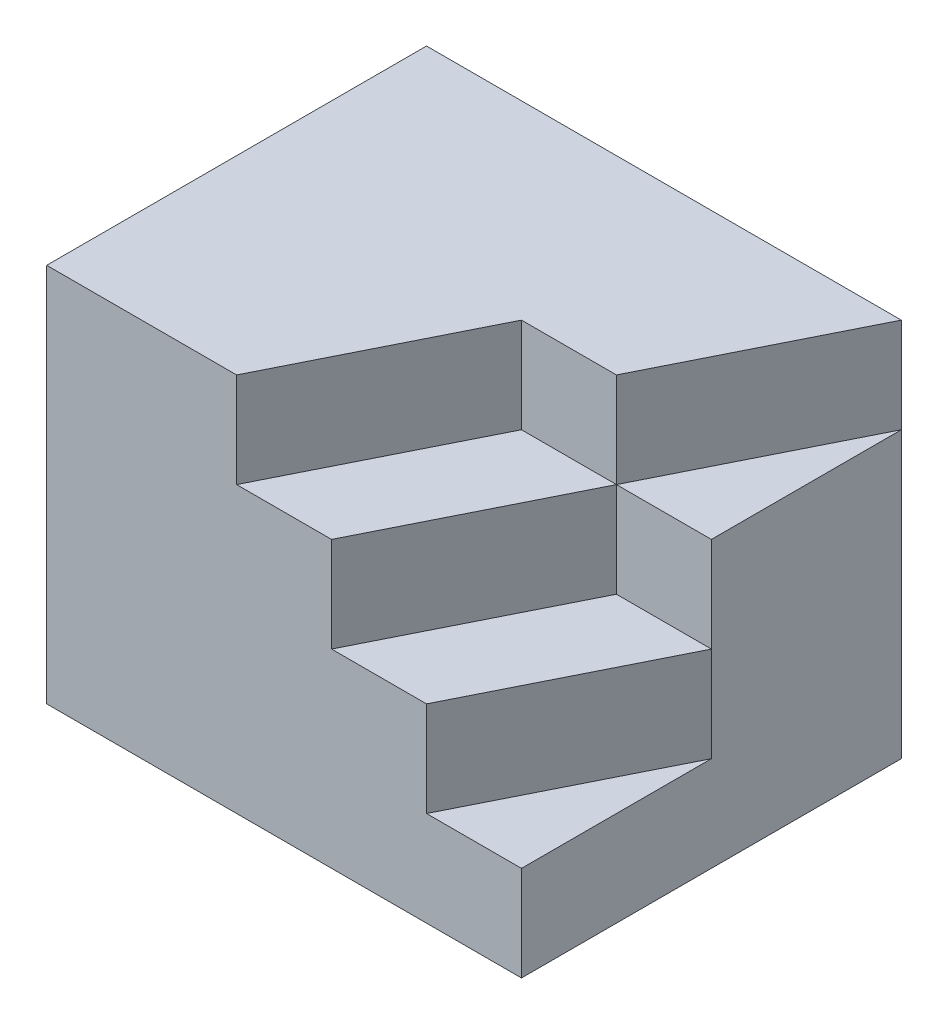
ISO-10303-21;
HEADER;
FILE_DESCRIPTION(('STEP AP214'),'2;1');
FILE_NAME('part.step','',(''),(''),'','','');
FILE_SCHEMA(('AUTOMOTIVE_DESIGN { 1 0 10303 214 1 1 1 1 }'));
ENDSEC;
DATA;
#1=APPLICATION_CONTEXT('core data for automotive mechanical design processes');
#2=APPLICATION_PROTOCOL_DEFINITION('international standard','automotive_design',2000,#1);
#3=PRODUCT_CONTEXT('',#1,'mechanical');
#4=PRODUCT('Part','Part','',(#3));
#5=PRODUCT_RELATED_PRODUCT_CATEGORY('part','',(#4));
#6=PRODUCT_DEFINITION_FORMATION('','',#4);
#7=PRODUCT_DEFINITION_CONTEXT('part definition',#1,'design');
#8=PRODUCT_DEFINITION('design','',#6,#7);
#9=PRODUCT_DEFINITION_SHAPE('','',#8);
#10=(LENGTH_UNIT() NAMED_UNIT(*) SI_UNIT(.MILLI.,.METRE.));
#11=(NAMED_UNIT(*) PLANE_ANGLE_UNIT() SI_UNIT($,.RADIAN.));
#12=(NAMED_UNIT(*) SI_UNIT($,.STERADIAN.) SOLID_ANGLE_UNIT());
#13=UNCERTAINTY_MEASURE_WITH_UNIT(LENGTH_MEASURE(1.E-05),#10,'distance_accuracy_value','');
#14=(GEOMETRIC_REPRESENTATION_CONTEXT(3) GLOBAL_UNCERTAINTY_ASSIGNED_CONTEXT((#13)) GLOBAL_UNIT_ASSIGNED_CONTEXT((#10,
#11,#12)) REPRESENTATION_CONTEXT('',''));
#15=CARTESIAN_POINT('',(0.,0.,0.));
#16=DIRECTION('',(0.,0.,1.));
#17=DIRECTION('',(1.,0.,0.));
#18=AXIS2_PLACEMENT_3D('',#15,#16,#17);
#19=CARTESIAN_POINT('',(-0.895238095238097,11.4285714285714,-0.533333333333332));
#20=DIRECTION('',(0.,0.,1.));
#21=DIRECTION('',(1.,0.,0.));
#22=AXIS2_PLACEMENT_3D('',#19,#20,#21);
#23=PLANE('',#22);
#24=DIRECTION('',(0.,-1.,0.));
#25=VECTOR('',#24,1.);
#26=CARTESIAN_POINT('',(0.604761904761902,10.4285714285714,-0.533333333333332));
#27=LINE('',#26,#25);
#28=CARTESIAN_POINT('',(0.604761904761902,10.4285714285714,-0.533333333333332));
#29=VERTEX_POINT('',#28);
#30=CARTESIAN_POINT('',(0.604761904761902,9.42857142857143,-0.533333333333332));
#31=VERTEX_POINT('',#30);
#32=EDGE_CURVE('E60',#29,#31,#27,.T.);
#33=ORIENTED_EDGE('',*,*,#32,.T.);
#34=DIRECTION('',(1.,0.,0.));
#35=VECTOR('',#34,1.);
#36=CARTESIAN_POINT('',(-0.895238095238097,9.42857142857143,-0.533333333333332));
#37=LINE('',#36,#35);
#38=CARTESIAN_POINT('',(1.6047619047619,9.42857142857143,-0.533333333333333));
#39=VERTEX_POINT('',#38);
#40=EDGE_CURVE('E11',#31,#39,#37,.T.);
#41=ORIENTED_EDGE('',*,*,#40,.T.);
#42=DIRECTION('',(0.,-1.,0.));
#43=VECTOR('',#42,1.);
#44=CARTESIAN_POINT('',(1.6047619047619,10.4285714285714,-0.533333333333333));
#45=LINE('',#44,#43);
#46=CARTESIAN_POINT('',(1.6047619047619,10.4285714285714,-0.533333333333333));
#47=VERTEX_POINT('',#46);
#48=EDGE_CURVE('E157',#47,#39,#45,.T.);
#49=ORIENTED_EDGE('',*,*,#48,.F.);
#50=DIRECTION('',(-1.,0.,0.));
#51=VECTOR('',#50,1.);
#52=CARTESIAN_POINT('',(-0.895238095238097,10.4285714285714,-0.533333333333332));
#53=LINE('',#52,#51);
#54=EDGE_CURVE('E152',#47,#29,#53,.T.);
#55=ORIENTED_EDGE('',*,*,#54,.T.);
#56=EDGE_LOOP('',(#33,#41,#49,#55));
#57=FACE_BOUND('',#56,.T.);
#58=ADVANCED_FACE('F38',(#57),#23,.T.);
#59=CARTESIAN_POINT('',(-0.895238095238097,9.42857142857143,-0.533333333333332));
#60=DIRECTION('',(0.,1.,0.));
#61=DIRECTION('',(0.,0.,1.));
#62=AXIS2_PLACEMENT_3D('',#59,#60,#61);
#63=PLANE('',#62);
#64=DIRECTION('',(0.447213595499958,0.,-0.894427190999916));
#65=VECTOR('',#64,1.);
#66=CARTESIAN_POINT('',(0.304761904761902,9.42857142857143,0.0666666666666672));
#67=LINE('',#66,#65);
#68=CARTESIAN_POINT('',(-0.395238095238098,9.42857142857143,1.46666666666667));
#69=VERTEX_POINT('',#68);
#70=EDGE_CURVE('E53',#69,#31,#67,.T.);
#71=ORIENTED_EDGE('',*,*,#70,.F.);
#72=DIRECTION('',(-1.,0.,0.));
#73=VECTOR('',#72,1.);
#74=CARTESIAN_POINT('',(-0.895238095238097,9.42857142857143,1.46666666666667));
#75=LINE('',#74,#73);
#76=CARTESIAN_POINT('',(0.604761904761903,9.42857142857143,1.46666666666667));
#77=VERTEX_POINT('',#76);
#78=EDGE_CURVE('E130',#77,#69,#75,.T.);
#79=ORIENTED_EDGE('',*,*,#78,.F.);
#80=DIRECTION('',(0.447213595499958,0.,-0.894427190999916));
#81=VECTOR('',#80,1.);
#82=CARTESIAN_POINT('',(1.1047619047619,9.42857142857143,0.466666666666667));
#83=LINE('',#82,#81);
#84=EDGE_CURVE('E189',#77,#39,#83,.T.);
#85=ORIENTED_EDGE('',*,*,#84,.T.);
#86=ORIENTED_EDGE('',*,*,#40,.F.);
#87=EDGE_LOOP('',(#71,#79,#85,#86));
#88=FACE_BOUND('',#87,.T.);
#89=ADVANCED_FACE('F254',(#88),#63,.T.);
#90=CARTESIAN_POINT('',(-0.895238095238097,8.42857142857143,-0.533333333333332));
#91=DIRECTION('',(0.,1.,0.));
#92=DIRECTION('',(0.,0.,1.));
#93=AXIS2_PLACEMENT_3D('',#90,#91,#92);
#94=PLANE('',#93);
#95=DIRECTION('',(0.,0.,1.));
#96=VECTOR('',#95,1.);
#97=CARTESIAN_POINT('',(1.6047619047619,8.42857142857143,-0.533333333333333));
#98=LINE('',#97,#96);
#99=CARTESIAN_POINT('',(1.6047619047619,8.42857142857143,-0.533333333333333));
#100=VERTEX_POINT('',#99);
#101=CARTESIAN_POINT('',(1.6047619047619,8.42857142857143,1.46666666666667));
#102=VERTEX_POINT('',#101);
#103=EDGE_CURVE('E201',#100,#102,#98,.T.);
#104=ORIENTED_EDGE('',*,*,#103,.F.);
#105=DIRECTION('',(-0.447213595499958,0.,0.894427190999916));
#106=VECTOR('',#105,1.);
#107=CARTESIAN_POINT('',(1.1047619047619,8.42857142857143,0.466666666666667));
#108=LINE('',#107,#106);
#109=CARTESIAN_POINT('',(0.604761904761903,8.42857142857143,1.46666666666667));
#110=VERTEX_POINT('',#109);
#111=EDGE_CURVE('E197',#100,#110,#108,.T.);
#112=ORIENTED_EDGE('',*,*,#111,.T.);
#113=DIRECTION('',(-1.,0.,0.));
#114=VECTOR('',#113,1.);
#115=CARTESIAN_POINT('',(-0.895238095238097,8.42857142857143,1.46666666666667));
#116=LINE('',#115,#114);
#117=EDGE_CURVE('E203',#102,#110,#116,.T.);
#118=ORIENTED_EDGE('',*,*,#117,.F.);
#119=EDGE_LOOP('',(#104,#112,#118));
#120=FACE_BOUND('',#119,.T.);
#121=ADVANCED_FACE('F258',(#120),#94,.T.);
#122=CARTESIAN_POINT('',(1.6047619047619,8.42857142857143,-0.533333333333333));
#123=DIRECTION('',(1.,0.,0.));
#124=DIRECTION('',(0.,0.,-1.));
#125=AXIS2_PLACEMENT_3D('',#122,#123,#124);
#126=PLANE('',#125);
#127=DIRECTION('',(0.,-1.,0.));
#128=VECTOR('',#127,1.);
#129=CARTESIAN_POINT('',(1.6047619047619,8.42857142857143,1.46666666666667));
#130=LINE('',#129,#128);
#131=CARTESIAN_POINT('',(1.6047619047619,7.42857142857143,1.46666666666667));
#132=VERTEX_POINT('',#131);
#133=EDGE_CURVE('E207',#102,#132,#130,.T.);
#134=ORIENTED_EDGE('',*,*,#133,.T.);
#135=DIRECTION('',(0.,0.,1.));
#136=VECTOR('',#135,1.);
#137=CARTESIAN_POINT('',(1.6047619047619,7.42857142857143,-0.533333333333333));
#138=LINE('',#137,#136);
#139=CARTESIAN_POINT('',(1.6047619047619,7.42857142857143,-2.53333333333333));
#140=VERTEX_POINT('',#139);
#141=EDGE_CURVE('E200',#140,#132,#138,.T.);
#142=ORIENTED_EDGE('',*,*,#141,.F.);
#143=DIRECTION('',(0.,-1.,0.));
#144=VECTOR('',#143,1.);
#145=CARTESIAN_POINT('',(1.6047619047619,8.42857142857143,-2.53333333333333));
#146=LINE('',#145,#144);
#147=CARTESIAN_POINT('',(1.6047619047619,10.4285714285714,-2.53333333333333));
#148=VERTEX_POINT('',#147);
#149=EDGE_CURVE('E46',#148,#140,#146,.T.);
#150=ORIENTED_EDGE('',*,*,#149,.F.);
#151=DIRECTION('',(0.,0.,1.));
#152=VECTOR('',#151,1.);
#153=CARTESIAN_POINT('',(1.6047619047619,10.4285714285714,-0.533333333333333));
#154=LINE('',#153,#152);
#155=EDGE_CURVE('E154',#148,#47,#154,.T.);
#156=ORIENTED_EDGE('',*,*,#155,.T.);
#157=ORIENTED_EDGE('',*,*,#48,.T.);
#158=DIRECTION('',(0.,-1.,0.));
#159=VECTOR('',#158,1.);
#160=CARTESIAN_POINT('',(1.6047619047619,9.42857142857143,-0.533333333333333));
#161=LINE('',#160,#159);
#162=EDGE_CURVE('E192',#39,#100,#161,.T.);
#163=ORIENTED_EDGE('',*,*,#162,.T.);
#164=ORIENTED_EDGE('',*,*,#103,.T.);
#165=EDGE_LOOP('',(#134,#142,#150,#156,#157,#163,#164));
#166=FACE_BOUND('',#165,.T.);
#167=ADVANCED_FACE('F40',(#166),#126,.T.);
#168=CARTESIAN_POINT('',(-0.895238095238098,8.42857142857143,-2.53333333333333));
#169=DIRECTION('',(0.,0.,1.));
#170=DIRECTION('',(1.,0.,0.));
#171=AXIS2_PLACEMENT_3D('',#168,#169,#170);
#172=PLANE('',#171);
#173=DIRECTION('',(-1.,0.,0.));
#174=VECTOR('',#173,1.);
#175=CARTESIAN_POINT('',(-0.895238095238098,7.42857142857143,-2.53333333333333));
#176=LINE('',#175,#174);
#177=CARTESIAN_POINT('',(-3.3952380952381,7.42857142857143,-2.53333333333333));
#178=VERTEX_POINT('',#177);
#179=EDGE_CURVE('E209',#140,#178,#176,.T.);
#180=ORIENTED_EDGE('',*,*,#179,.T.);
#181=DIRECTION('',(0.,-1.,0.));
#182=VECTOR('',#181,1.);
#183=CARTESIAN_POINT('',(-3.3952380952381,8.42857142857143,-2.53333333333333));
#184=LINE('',#183,#182);
#185=CARTESIAN_POINT('',(-3.3952380952381,11.4285714285714,-2.53333333333333));
#186=VERTEX_POINT('',#185);
#187=EDGE_CURVE('E220',#186,#178,#184,.T.);
#188=ORIENTED_EDGE('',*,*,#187,.F.);
#189=DIRECTION('',(-1.,0.,0.));
#190=VECTOR('',#189,1.);
#191=CARTESIAN_POINT('',(-0.895238095238098,11.4285714285714,-2.53333333333333));
#192=LINE('',#191,#190);
#193=CARTESIAN_POINT('',(1.6047619047619,11.4285714285714,-2.53333333333333));
#194=VERTEX_POINT('',#193);
#195=EDGE_CURVE('E165',#194,#186,#192,.T.);
#196=ORIENTED_EDGE('',*,*,#195,.F.);
#197=DIRECTION('',(0.,-1.,0.));
#198=VECTOR('',#197,1.);
#199=CARTESIAN_POINT('',(1.6047619047619,11.4285714285714,-2.53333333333333));
#200=LINE('',#199,#198);
#201=EDGE_CURVE('E182',#194,#148,#200,.T.);
#202=ORIENTED_EDGE('',*,*,#201,.T.);
#203=ORIENTED_EDGE('',*,*,#149,.T.);
#204=EDGE_LOOP('',(#180,#188,#196,#202,#203));
#205=FACE_BOUND('',#204,.T.);
#206=ADVANCED_FACE('F224',(#205),#172,.F.);
#207=CARTESIAN_POINT('',(-3.3952380952381,8.42857142857143,-0.533333333333332));
#208=DIRECTION('',(1.,0.,0.));
#209=DIRECTION('',(0.,0.,-1.));
#210=AXIS2_PLACEMENT_3D('',#207,#208,#209);
#211=PLANE('',#210);
#212=DIRECTION('',(0.,0.,1.));
#213=VECTOR('',#212,1.);
#214=CARTESIAN_POINT('',(-3.3952380952381,7.42857142857143,-0.533333333333332));
#215=LINE('',#214,#213);
#216=CARTESIAN_POINT('',(-3.3952380952381,7.42857142857143,1.46666666666667));
#217=VERTEX_POINT('',#216);
#218=EDGE_CURVE('E211',#178,#217,#215,.T.);
#219=ORIENTED_EDGE('',*,*,#218,.T.);
#220=DIRECTION('',(0.,-1.,0.));
#221=VECTOR('',#220,1.);
#222=CARTESIAN_POINT('',(-3.3952380952381,8.42857142857143,1.46666666666667));
#223=LINE('',#222,#221);
#224=CARTESIAN_POINT('',(-3.3952380952381,11.4285714285714,1.46666666666667));
#225=VERTEX_POINT('',#224);
#226=EDGE_CURVE('E217',#225,#217,#223,.T.);
#227=ORIENTED_EDGE('',*,*,#226,.F.);
#228=DIRECTION('',(0.,0.,1.));
#229=VECTOR('',#228,1.);
#230=CARTESIAN_POINT('',(-3.3952380952381,11.4285714285714,-0.533333333333332));
#231=LINE('',#230,#229);
#232=EDGE_CURVE('E168',#186,#225,#231,.T.);
#233=ORIENTED_EDGE('',*,*,#232,.F.);
#234=ORIENTED_EDGE('',*,*,#187,.T.);
#235=EDGE_LOOP('',(#219,#227,#233,#234));
#236=FACE_BOUND('',#235,.T.);
#237=ADVANCED_FACE('F240',(#236),#211,.F.);
#238=CARTESIAN_POINT('',(-0.895238095238097,8.42857142857143,1.46666666666667));
#239=DIRECTION('',(0.,0.,1.));
#240=DIRECTION('',(1.,0.,0.));
#241=AXIS2_PLACEMENT_3D('',#238,#239,#240);
#242=PLANE('',#241);
#243=ORIENTED_EDGE('',*,*,#78,.T.);
#244=DIRECTION('',(0.,-1.,0.));
#245=VECTOR('',#244,1.);
#246=CARTESIAN_POINT('',(-0.395238095238098,10.4285714285714,1.46666666666667));
#247=LINE('',#246,#245);
#248=CARTESIAN_POINT('',(-0.395238095238098,10.4285714285714,1.46666666666667));
#249=VERTEX_POINT('',#248);
#250=EDGE_CURVE('E125',#249,#69,#247,.T.);
#251=ORIENTED_EDGE('',*,*,#250,.F.);
#252=DIRECTION('',(-1.,0.,0.));
#253=VECTOR('',#252,1.);
#254=CARTESIAN_POINT('',(-0.895238095238097,10.4285714285714,1.46666666666667));
#255=LINE('',#254,#253);
#256=CARTESIAN_POINT('',(-1.3952380952381,10.4285714285714,1.46666666666667));
#257=VERTEX_POINT('',#256);
#258=EDGE_CURVE('E129',#249,#257,#255,.T.);
#259=ORIENTED_EDGE('',*,*,#258,.T.);
#260=DIRECTION('',(0.,-1.,0.));
#261=VECTOR('',#260,1.);
#262=CARTESIAN_POINT('',(-1.3952380952381,11.4285714285714,1.46666666666667));
#263=LINE('',#262,#261);
#264=CARTESIAN_POINT('',(-1.3952380952381,11.4285714285714,1.46666666666667));
#265=VERTEX_POINT('',#264);
#266=EDGE_CURVE('E180',#265,#257,#263,.T.);
#267=ORIENTED_EDGE('',*,*,#266,.F.);
#268=DIRECTION('',(-1.,0.,0.));
#269=VECTOR('',#268,1.);
#270=CARTESIAN_POINT('',(-0.895238095238097,11.4285714285714,1.46666666666667));
#271=LINE('',#270,#269);
#272=EDGE_CURVE('E171',#265,#225,#271,.T.);
#273=ORIENTED_EDGE('',*,*,#272,.T.);
#274=ORIENTED_EDGE('',*,*,#226,.T.);
#275=DIRECTION('',(-1.,0.,0.));
#276=VECTOR('',#275,1.);
#277=CARTESIAN_POINT('',(-0.895238095238097,7.42857142857143,1.46666666666667));
#278=LINE('',#277,#276);
#279=EDGE_CURVE('E204',#132,#217,#278,.T.);
#280=ORIENTED_EDGE('',*,*,#279,.F.);
#281=ORIENTED_EDGE('',*,*,#133,.F.);
#282=ORIENTED_EDGE('',*,*,#117,.T.);
#283=DIRECTION('',(0.,-1.,0.));
#284=VECTOR('',#283,1.);
#285=CARTESIAN_POINT('',(0.604761904761903,9.42857142857143,1.46666666666667));
#286=LINE('',#285,#284);
#287=EDGE_CURVE('E195',#77,#110,#286,.T.);
#288=ORIENTED_EDGE('',*,*,#287,.F.);
#289=EDGE_LOOP('',(#243,#251,#259,#267,#273,#274,#280,#281,#282,#288));
#290=FACE_BOUND('',#289,.T.);
#291=ADVANCED_FACE('F127',(#290),#242,.T.);
#292=CARTESIAN_POINT('',(-0.895238095238097,7.42857142857143,-0.533333333333332));
#293=DIRECTION('',(0.,1.,0.));
#294=DIRECTION('',(0.,0.,1.));
#295=AXIS2_PLACEMENT_3D('',#292,#293,#294);
#296=PLANE('',#295);
#297=ORIENTED_EDGE('',*,*,#279,.T.);
#298=ORIENTED_EDGE('',*,*,#218,.F.);
#299=ORIENTED_EDGE('',*,*,#179,.F.);
#300=ORIENTED_EDGE('',*,*,#141,.T.);
#301=EDGE_LOOP('',(#297,#298,#299,#300));
#302=FACE_BOUND('',#301,.T.);
#303=ADVANCED_FACE('F232',(#302),#296,.F.);
#304=CARTESIAN_POINT('',(1.1047619047619,9.42857142857143,0.466666666666667));
#305=DIRECTION('',(-0.894427190999916,0.,-0.447213595499958));
#306=DIRECTION('',(-0.447213595499958,0.,0.894427190999916));
#307=AXIS2_PLACEMENT_3D('',#304,#305,#306);
#308=PLANE('',#307);
#309=ORIENTED_EDGE('',*,*,#111,.F.);
#310=ORIENTED_EDGE('',*,*,#162,.F.);
#311=ORIENTED_EDGE('',*,*,#84,.F.);
#312=ORIENTED_EDGE('',*,*,#287,.T.);
#313=EDGE_LOOP('',(#309,#310,#311,#312));
#314=FACE_BOUND('',#313,.T.);
#315=ADVANCED_FACE('F256',(#314),#308,.F.);
#316=DIRECTION('',(-1.,0.,0.));
#317=VECTOR('',#316,1.);
#318=CARTESIAN_POINT('',(-0.895238095238097,10.4285714285714,-0.533333333333332));
#319=LINE('',#318,#317);
#320=CARTESIAN_POINT('',(-0.395238095238098,10.4285714285714,-0.533333333333332));
#321=VERTEX_POINT('',#320);
#322=EDGE_CURVE('E142',#29,#321,#319,.T.);
#323=ORIENTED_EDGE('',*,*,#322,.F.);
#324=DIRECTION('',(0.,-1.,0.));
#325=VECTOR('',#324,1.);
#326=CARTESIAN_POINT('',(0.604761904761902,11.4285714285714,-0.533333333333332));
#327=LINE('',#326,#325);
#328=CARTESIAN_POINT('',(0.604761904761902,11.4285714285714,-0.533333333333332));
#329=VERTEX_POINT('',#328);
#330=EDGE_CURVE('E185',#329,#29,#327,.T.);
#331=ORIENTED_EDGE('',*,*,#330,.F.);
#332=DIRECTION('',(-1.,0.,0.));
#333=VECTOR('',#332,1.);
#334=CARTESIAN_POINT('',(-0.895238095238097,11.4285714285714,-0.533333333333332));
#335=LINE('',#334,#333);
#336=CARTESIAN_POINT('',(-0.395238095238098,11.4285714285714,-0.533333333333332));
#337=VERTEX_POINT('',#336);
#338=EDGE_CURVE('E160',#329,#337,#335,.T.);
#339=ORIENTED_EDGE('',*,*,#338,.T.);
#340=DIRECTION('',(0.,-1.,0.));
#341=VECTOR('',#340,1.);
#342=CARTESIAN_POINT('',(-0.395238095238098,11.4285714285714,-0.533333333333332));
#343=LINE('',#342,#341);
#344=EDGE_CURVE('E177',#337,#321,#343,.T.);
#345=ORIENTED_EDGE('',*,*,#344,.T.);
#346=EDGE_LOOP('',(#323,#331,#339,#345));
#347=FACE_BOUND('',#346,.T.);
#348=ADVANCED_FACE('F270',(#347),#23,.T.);
#349=CARTESIAN_POINT('',(0.304761904761903,11.4285714285714,0.0666666666666673));
#350=DIRECTION('',(-0.894427190999916,0.,-0.447213595499958));
#351=DIRECTION('',(-0.447213595499958,0.,0.894427190999916));
#352=AXIS2_PLACEMENT_3D('',#349,#350,#351);
#353=PLANE('',#352);
#354=ORIENTED_EDGE('',*,*,#330,.T.);
#355=DIRECTION('',(0.447213595499958,0.,-0.894427190999916));
#356=VECTOR('',#355,1.);
#357=CARTESIAN_POINT('',(0.304761904761903,10.4285714285714,0.0666666666666673));
#358=LINE('',#357,#356);
#359=EDGE_CURVE('E149',#29,#148,#358,.T.);
#360=ORIENTED_EDGE('',*,*,#359,.T.);
#361=ORIENTED_EDGE('',*,*,#201,.F.);
#362=DIRECTION('',(0.447213595499958,0.,-0.894427190999916));
#363=VECTOR('',#362,1.);
#364=CARTESIAN_POINT('',(0.304761904761903,11.4285714285714,0.0666666666666673));
#365=LINE('',#364,#363);
#366=EDGE_CURVE('E163',#329,#194,#365,.T.);
#367=ORIENTED_EDGE('',*,*,#366,.F.);
#368=EDGE_LOOP('',(#354,#360,#361,#367));
#369=FACE_BOUND('',#368,.T.);
#370=ADVANCED_FACE('F247',(#369),#353,.F.);
#371=CARTESIAN_POINT('',(-0.495238095238098,11.4285714285714,-0.333333333333333));
#372=DIRECTION('',(0.894427190999916,0.,0.447213595499958));
#373=DIRECTION('',(0.447213595499958,0.,-0.894427190999916));
#374=AXIS2_PLACEMENT_3D('',#371,#372,#373);
#375=PLANE('',#374);
#376=DIRECTION('',(-0.447213595499958,0.,0.894427190999916));
#377=VECTOR('',#376,1.);
#378=CARTESIAN_POINT('',(-0.495238095238098,10.4285714285714,-0.333333333333333));
#379=LINE('',#378,#377);
#380=EDGE_CURVE('E141',#321,#257,#379,.T.);
#381=ORIENTED_EDGE('',*,*,#380,.F.);
#382=ORIENTED_EDGE('',*,*,#344,.F.);
#383=DIRECTION('',(-0.447213595499958,0.,0.894427190999916));
#384=VECTOR('',#383,1.);
#385=CARTESIAN_POINT('',(-0.495238095238098,11.4285714285714,-0.333333333333333));
#386=LINE('',#385,#384);
#387=EDGE_CURVE('E174',#337,#265,#386,.T.);
#388=ORIENTED_EDGE('',*,*,#387,.T.);
#389=ORIENTED_EDGE('',*,*,#266,.T.);
#390=EDGE_LOOP('',(#381,#382,#388,#389));
#391=FACE_BOUND('',#390,.T.);
#392=ADVANCED_FACE('F280',(#391),#375,.T.);
#393=CARTESIAN_POINT('',(-0.895238095238097,11.4285714285714,-0.533333333333332));
#394=DIRECTION('',(0.,1.,0.));
#395=DIRECTION('',(0.,0.,1.));
#396=AXIS2_PLACEMENT_3D('',#393,#394,#395);
#397=PLANE('',#396);
#398=ORIENTED_EDGE('',*,*,#338,.F.);
#399=ORIENTED_EDGE('',*,*,#366,.T.);
#400=ORIENTED_EDGE('',*,*,#195,.T.);
#401=ORIENTED_EDGE('',*,*,#232,.T.);
#402=ORIENTED_EDGE('',*,*,#272,.F.);
#403=ORIENTED_EDGE('',*,*,#387,.F.);
#404=EDGE_LOOP('',(#398,#399,#400,#401,#402,#403));
#405=FACE_BOUND('',#404,.T.);
#406=ADVANCED_FACE('F243',(#405),#397,.T.);
#407=CARTESIAN_POINT('',(-0.895238095238097,10.4285714285714,-0.533333333333332));
#408=DIRECTION('',(0.,1.,0.));
#409=DIRECTION('',(0.,0.,1.));
#410=AXIS2_PLACEMENT_3D('',#407,#408,#409);
#411=PLANE('',#410);
#412=ORIENTED_EDGE('',*,*,#359,.F.);
#413=ORIENTED_EDGE('',*,*,#54,.F.);
#414=ORIENTED_EDGE('',*,*,#155,.F.);
#415=EDGE_LOOP('',(#412,#413,#414));
#416=FACE_BOUND('',#415,.T.);
#417=ADVANCED_FACE('F251',(#416),#411,.T.);
#418=CARTESIAN_POINT('',(0.304761904761903,10.4285714285714,0.0666666666666673));
#419=DIRECTION('',(0.894427190999916,0.,0.447213595499958));
#420=DIRECTION('',(0.447213595499958,0.,-0.894427190999916));
#421=AXIS2_PLACEMENT_3D('',#418,#419,#420);
#422=PLANE('',#421);
#423=ORIENTED_EDGE('',*,*,#250,.T.);
#424=ORIENTED_EDGE('',*,*,#70,.T.);
#425=ORIENTED_EDGE('',*,*,#32,.F.);
#426=DIRECTION('',(-0.447213595499958,0.,0.894427190999916));
#427=VECTOR('',#426,1.);
#428=CARTESIAN_POINT('',(0.304761904761903,10.4285714285714,0.0666666666666673));
#429=LINE('',#428,#427);
#430=EDGE_CURVE('E132',#29,#249,#429,.T.);
#431=ORIENTED_EDGE('',*,*,#430,.T.);
#432=EDGE_LOOP('',(#423,#424,#425,#431));
#433=FACE_BOUND('',#432,.T.);
#434=ADVANCED_FACE('F135',(#433),#422,.T.);
#435=CARTESIAN_POINT('',(-0.895238095238097,10.4285714285714,-0.533333333333332));
#436=DIRECTION('',(0.,1.,0.));
#437=DIRECTION('',(0.,0.,1.));
#438=AXIS2_PLACEMENT_3D('',#435,#436,#437);
#439=PLANE('',#438);
#440=ORIENTED_EDGE('',*,*,#430,.F.);
#441=ORIENTED_EDGE('',*,*,#322,.T.);
#442=ORIENTED_EDGE('',*,*,#380,.T.);
#443=ORIENTED_EDGE('',*,*,#258,.F.);
#444=EDGE_LOOP('',(#440,#441,#442,#443));
#445=FACE_BOUND('',#444,.T.);
#446=ADVANCED_FACE('F140',(#445),#439,.T.);
#447=CLOSED_SHELL('',(#58,#89,#121,#167,#206,#237,#291,#303,#315,#348,#370,#392,#406,#417,#434,#446));
#448=MANIFOLD_SOLID_BREP('B2',#447);
#449=ADVANCED_BREP_SHAPE_REPRESENTATION('',(#18,#448),#14);
#450=SHAPE_DEFINITION_REPRESENTATION(#9,#449);
ENDSEC;
END-ISO-10303-21;
